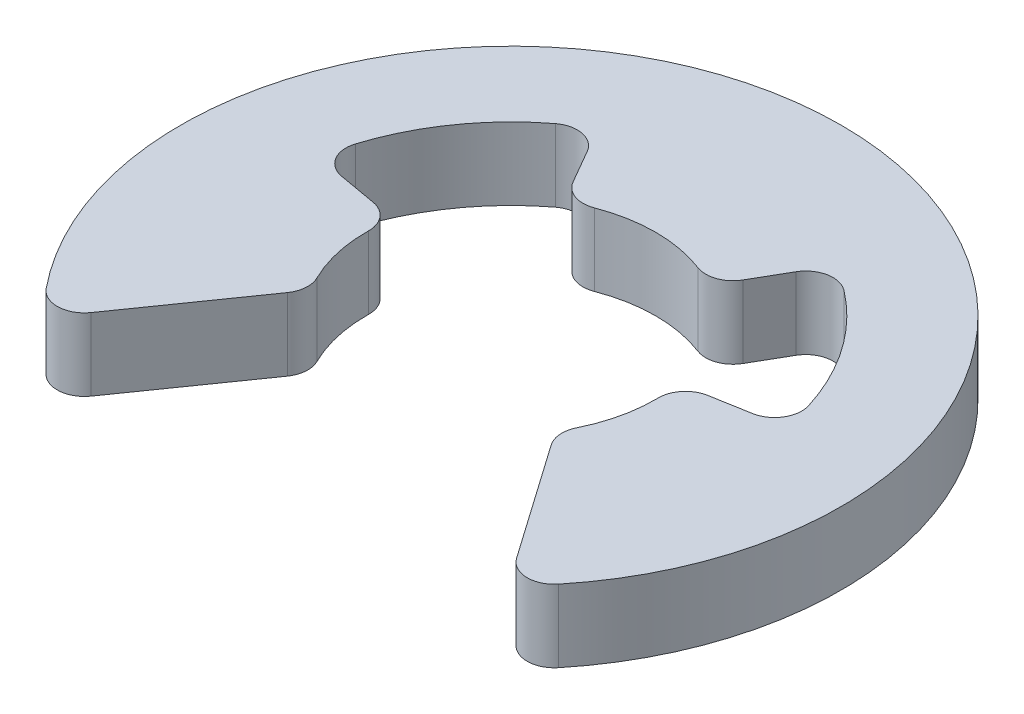
ISO-10303-21;
HEADER;
FILE_DESCRIPTION(('STEP AP214'),'2;1');
FILE_NAME('part.step','',(''),(''),'','','');
FILE_SCHEMA(('AUTOMOTIVE_DESIGN { 1 0 10303 214 1 1 1 1 }'));
ENDSEC;
DATA;
#1=APPLICATION_CONTEXT('core data for automotive mechanical design processes');
#2=APPLICATION_PROTOCOL_DEFINITION('international standard','automotive_design',2000,#1);
#3=PRODUCT_CONTEXT('',#1,'mechanical');
#4=PRODUCT('Part','Part','',(#3));
#5=PRODUCT_RELATED_PRODUCT_CATEGORY('part','',(#4));
#6=PRODUCT_DEFINITION_FORMATION('','',#4);
#7=PRODUCT_DEFINITION_CONTEXT('part definition',#1,'design');
#8=PRODUCT_DEFINITION('design','',#6,#7);
#9=PRODUCT_DEFINITION_SHAPE('','',#8);
#10=(LENGTH_UNIT() NAMED_UNIT(*) SI_UNIT(.MILLI.,.METRE.));
#11=(NAMED_UNIT(*) PLANE_ANGLE_UNIT() SI_UNIT($,.RADIAN.));
#12=(NAMED_UNIT(*) SI_UNIT($,.STERADIAN.) SOLID_ANGLE_UNIT());
#13=UNCERTAINTY_MEASURE_WITH_UNIT(LENGTH_MEASURE(1.E-05),#10,'distance_accuracy_value','');
#14=(GEOMETRIC_REPRESENTATION_CONTEXT(3) GLOBAL_UNCERTAINTY_ASSIGNED_CONTEXT((#13)) GLOBAL_UNIT_ASSIGNED_CONTEXT((#10,
#11,#12)) REPRESENTATION_CONTEXT('',''));
#15=CARTESIAN_POINT('',(0.,0.,0.));
#16=DIRECTION('',(0.,0.,1.));
#17=DIRECTION('',(1.,0.,0.));
#18=AXIS2_PLACEMENT_3D('',#15,#16,#17);
#19=CARTESIAN_POINT('',(0.,0.5,0.));
#20=DIRECTION('',(0.,1.,0.));
#21=DIRECTION('',(0.,0.,1.));
#22=AXIS2_PLACEMENT_3D('',#19,#20,#21);
#23=CYLINDRICAL_SURFACE('',#22,1.6);
#24=CARTESIAN_POINT('',(0.,-0.3,0.));
#25=DIRECTION('',(0.,1.,0.));
#26=DIRECTION('',(0.,0.,1.));
#27=AXIS2_PLACEMENT_3D('',#24,#25,#26);
#28=CIRCLE('',#27,1.6);
#29=CARTESIAN_POINT('',(1.43474212961886,-0.3,0.708177252880062));
#30=VERTEX_POINT('',#29);
#31=CARTESIAN_POINT('',(1.5997958529263,-0.3,-0.0255583442305522));
#32=VERTEX_POINT('',#31);
#33=EDGE_CURVE('E207',#30,#32,#28,.T.);
#34=ORIENTED_EDGE('',*,*,#33,.F.);
#35=DIRECTION('',(0.,1.,0.));
#36=VECTOR('',#35,1.);
#37=CARTESIAN_POINT('',(1.43474212961886,0.5,0.708177252880062));
#38=LINE('',#37,#36);
#39=CARTESIAN_POINT('',(1.43474212961886,0.5,0.708177252880062));
#40=VERTEX_POINT('',#39);
#41=EDGE_CURVE('E222',#30,#40,#38,.T.);
#42=ORIENTED_EDGE('',*,*,#41,.T.);
#43=CARTESIAN_POINT('',(0.,0.5,0.));
#44=DIRECTION('',(0.,1.,0.));
#45=DIRECTION('',(0.,0.,1.));
#46=AXIS2_PLACEMENT_3D('',#43,#44,#45);
#47=CIRCLE('',#46,1.6);
#48=CARTESIAN_POINT('',(1.5997958529263,0.5,-0.0255583442305522));
#49=VERTEX_POINT('',#48);
#50=EDGE_CURVE('E333',#40,#49,#47,.T.);
#51=ORIENTED_EDGE('',*,*,#50,.T.);
#52=DIRECTION('',(0.,1.,0.));
#53=VECTOR('',#52,1.);
#54=CARTESIAN_POINT('',(1.5997958529263,0.5,-0.0255583442305522));
#55=LINE('',#54,#53);
#56=EDGE_CURVE('E225',#49,#32,#55,.F.);
#57=ORIENTED_EDGE('',*,*,#56,.T.);
#58=EDGE_LOOP('',(#34,#42,#51,#57));
#59=FACE_BOUND('',#58,.T.);
#60=ADVANCED_FACE('F33',(#59),#23,.F.);
#61=CARTESIAN_POINT('',(0.571179394382626,-0.3,-1.49457488920184));
#62=VERTEX_POINT('',#61);
#63=CARTESIAN_POINT('',(-0.571179394382626,-0.3,-1.49457488920184));
#64=VERTEX_POINT('',#63);
#65=EDGE_CURVE('E344',#62,#64,#28,.T.);
#66=ORIENTED_EDGE('',*,*,#65,.F.);
#67=DIRECTION('',(0.,1.,0.));
#68=VECTOR('',#67,1.);
#69=CARTESIAN_POINT('',(0.571179394382626,0.5,-1.49457488920184));
#70=LINE('',#69,#68);
#71=CARTESIAN_POINT('',(0.571179394382626,0.5,-1.49457488920184));
#72=VERTEX_POINT('',#71);
#73=EDGE_CURVE('E265',#62,#72,#70,.T.);
#74=ORIENTED_EDGE('',*,*,#73,.T.);
#75=CARTESIAN_POINT('',(-0.571179394382626,0.5,-1.49457488920184));
#76=VERTEX_POINT('',#75);
#77=EDGE_CURVE('E337',#72,#76,#47,.T.);
#78=ORIENTED_EDGE('',*,*,#77,.T.);
#79=DIRECTION('',(0.,1.,0.));
#80=VECTOR('',#79,1.);
#81=CARTESIAN_POINT('',(-0.571179394382626,0.5,-1.49457488920184));
#82=LINE('',#81,#80);
#83=EDGE_CURVE('E263',#76,#64,#82,.F.);
#84=ORIENTED_EDGE('',*,*,#83,.T.);
#85=EDGE_LOOP('',(#66,#74,#78,#84));
#86=FACE_BOUND('',#85,.T.);
#87=ADVANCED_FACE('F383',(#86),#23,.F.);
#88=CARTESIAN_POINT('',(-1.5997958529263,-0.3,-0.0255583442305521));
#89=VERTEX_POINT('',#88);
#90=CARTESIAN_POINT('',(-1.43474212961886,-0.3,0.708177252880062));
#91=VERTEX_POINT('',#90);
#92=EDGE_CURVE('E343',#89,#91,#28,.T.);
#93=ORIENTED_EDGE('',*,*,#92,.F.);
#94=DIRECTION('',(0.,1.,0.));
#95=VECTOR('',#94,1.);
#96=CARTESIAN_POINT('',(-1.5997958529263,0.5,-0.0255583442305521));
#97=LINE('',#96,#95);
#98=CARTESIAN_POINT('',(-1.5997958529263,0.5,-0.0255583442305521));
#99=VERTEX_POINT('',#98);
#100=EDGE_CURVE('E270',#89,#99,#97,.T.);
#101=ORIENTED_EDGE('',*,*,#100,.T.);
#102=CARTESIAN_POINT('',(-1.43474212961886,0.5,0.708177252880062));
#103=VERTEX_POINT('',#102);
#104=EDGE_CURVE('E216',#99,#103,#47,.T.);
#105=ORIENTED_EDGE('',*,*,#104,.T.);
#106=DIRECTION('',(0.,1.,0.));
#107=VECTOR('',#106,1.);
#108=CARTESIAN_POINT('',(-1.43474212961886,0.5,0.708177252880062));
#109=LINE('',#108,#107);
#110=EDGE_CURVE('E268',#103,#91,#109,.F.);
#111=ORIENTED_EDGE('',*,*,#110,.T.);
#112=EDGE_LOOP('',(#93,#101,#105,#111));
#113=FACE_BOUND('',#112,.T.);
#114=ADVANCED_FACE('F440',(#113),#23,.F.);
#115=CARTESIAN_POINT('',(1.6,-0.3,0.));
#116=DIRECTION('',(0.,1.,0.));
#117=DIRECTION('',(0.,0.,1.));
#118=AXIS2_PLACEMENT_3D('',#115,#116,#117);
#119=PLANE('',#118);
#120=CARTESIAN_POINT('',(0.,-0.3,0.));
#121=DIRECTION('',(0.,1.,0.));
#122=DIRECTION('',(0.,0.,1.));
#123=AXIS2_PLACEMENT_3D('',#120,#121,#122);
#124=CIRCLE('',#123,3.65);
#125=CARTESIAN_POINT('',(2.82936417668953,-0.3,2.3059051055206));
#126=VERTEX_POINT('',#125);
#127=CARTESIAN_POINT('',(-2.82936417668953,-0.3,2.3059051055206));
#128=VERTEX_POINT('',#127);
#129=EDGE_CURVE('E340',#126,#128,#124,.T.);
#130=ORIENTED_EDGE('',*,*,#129,.F.);
#131=CARTESIAN_POINT('',(2.59681369641368,-0.3,2.11637865849151));
#132=DIRECTION('',(0.,1.,0.));
#133=DIRECTION('',(0.,0.,1.));
#134=AXIS2_PLACEMENT_3D('',#131,#132,#133);
#135=CIRCLE('',#134,0.3);
#136=CARTESIAN_POINT('',(2.35106808312698,-0.3,2.28845158939683));
#137=VERTEX_POINT('',#136);
#138=EDGE_CURVE('E215',#126,#137,#135,.F.);
#139=ORIENTED_EDGE('',*,*,#138,.T.);
#140=DIRECTION('',(0.573576436351047,0.,0.819152044288991));
#141=VECTOR('',#140,1.);
#142=CARTESIAN_POINT('',(2.56616027524785,-0.3,2.59563507484004));
#143=LINE('',#142,#141);
#144=CARTESIAN_POINT('',(1.45801066563569,-0.3,1.01303341870039));
#145=VERTEX_POINT('',#144);
#146=EDGE_CURVE('E200',#145,#137,#143,.T.);
#147=ORIENTED_EDGE('',*,*,#146,.F.);
#148=CARTESIAN_POINT('',(1.70375627892239,-0.3,0.840960487795073));
#149=DIRECTION('',(0.,1.,0.));
#150=DIRECTION('',(0.,0.,1.));
#151=AXIS2_PLACEMENT_3D('',#148,#149,#150);
#152=CIRCLE('',#151,0.3);
#153=EDGE_CURVE('E212',#145,#30,#152,.F.);
#154=ORIENTED_EDGE('',*,*,#153,.T.);
#155=ORIENTED_EDGE('',*,*,#33,.T.);
#156=CARTESIAN_POINT('',(1.89975757534998,-0.3,-0.0303505337737807));
#157=DIRECTION('',(0.,1.,0.));
#158=DIRECTION('',(0.,0.,1.));
#159=AXIS2_PLACEMENT_3D('',#156,#157,#158);
#160=CIRCLE('',#159,0.3);
#161=CARTESIAN_POINT('',(1.8476631220499,-0.3,-0.325792859677443));
#162=VERTEX_POINT('',#161);
#163=EDGE_CURVE('E223',#32,#162,#160,.F.);
#164=ORIENTED_EDGE('',*,*,#163,.T.);
#165=DIRECTION('',(-0.984807753012207,0.,0.173648177666934));
#166=VECTOR('',#165,1.);
#167=CARTESIAN_POINT('',(2.58512035165704,-0.3,-0.455826466375703));
#168=LINE('',#167,#166);
#169=CARTESIAN_POINT('',(2.27053722578656,-0.3,-0.400356973609128));
#170=VERTEX_POINT('',#169);
#171=EDGE_CURVE('E217',#170,#162,#168,.T.);
#172=ORIENTED_EDGE('',*,*,#171,.F.);
#173=CARTESIAN_POINT('',(2.21844277248648,-0.3,-0.69579929951279));
#174=DIRECTION('',(0.,1.,0.));
#175=DIRECTION('',(0.,0.,1.));
#176=AXIS2_PLACEMENT_3D('',#173,#174,#175);
#177=CIRCLE('',#176,0.3);
#178=CARTESIAN_POINT('',(2.50469345280732,-0.3,-0.785579854288634));
#179=VERTEX_POINT('',#178);
#180=EDGE_CURVE('E279',#170,#179,#177,.T.);
#181=ORIENTED_EDGE('',*,*,#180,.T.);
#182=CARTESIAN_POINT('',(0.,-0.3,0.));
#183=DIRECTION('',(0.,-1.,0.));
#184=DIRECTION('',(0.,0.,1.));
#185=AXIS2_PLACEMENT_3D('',#182,#183,#184);
#186=CIRCLE('',#185,2.625);
#187=CARTESIAN_POINT('',(1.59485920582913,-0.3,-2.08495782057625));
#188=VERTEX_POINT('',#187);
#189=EDGE_CURVE('E328',#188,#179,#186,.T.);
#190=ORIENTED_EDGE('',*,*,#189,.F.);
#191=CARTESIAN_POINT('',(1.4125895823058,-0.3,-1.84667692679611));
#192=DIRECTION('',(0.,1.,0.));
#193=DIRECTION('',(0.,0.,1.));
#194=AXIS2_PLACEMENT_3D('',#191,#192,#193);
#195=CIRCLE('',#194,0.3);
#196=CARTESIAN_POINT('',(1.15278196117047,-0.3,-1.99667692679611));
#197=VERTEX_POINT('',#196);
#198=EDGE_CURVE('E283',#188,#197,#195,.T.);
#199=ORIENTED_EDGE('',*,*,#198,.T.);
#200=DIRECTION('',(0.500000000000007,0.,-0.866025403784435));
#201=VECTOR('',#200,1.);
#202=CARTESIAN_POINT('',(1.31250000000002,-0.3,-2.27331668493414));
#203=LINE('',#202,#201);
#204=CARTESIAN_POINT('',(0.938083151964699,-0.3,-1.62480768092718));
#205=VERTEX_POINT('',#204);
#206=EDGE_CURVE('E325',#205,#197,#203,.T.);
#207=ORIENTED_EDGE('',*,*,#206,.F.);
#208=CARTESIAN_POINT('',(0.678275530829369,-0.3,-1.77480768092719));
#209=DIRECTION('',(0.,1.,0.));
#210=DIRECTION('',(0.,0.,1.));
#211=AXIS2_PLACEMENT_3D('',#208,#209,#210);
#212=CIRCLE('',#211,0.3);
#213=EDGE_CURVE('E227',#205,#62,#212,.F.);
#214=ORIENTED_EDGE('',*,*,#213,.T.);
#215=ORIENTED_EDGE('',*,*,#65,.T.);
#216=CARTESIAN_POINT('',(-0.678275530829369,-0.3,-1.77480768092719));
#217=DIRECTION('',(0.,1.,0.));
#218=DIRECTION('',(0.,0.,1.));
#219=AXIS2_PLACEMENT_3D('',#216,#217,#218);
#220=CIRCLE('',#219,0.3);
#221=CARTESIAN_POINT('',(-0.938083151964699,-0.3,-1.62480768092718));
#222=VERTEX_POINT('',#221);
#223=EDGE_CURVE('E373',#64,#222,#220,.F.);
#224=ORIENTED_EDGE('',*,*,#223,.T.);
#225=DIRECTION('',(0.500000000000007,0.,0.866025403784435));
#226=VECTOR('',#225,1.);
#227=CARTESIAN_POINT('',(-1.31250000000002,-0.3,-2.27331668493414));
#228=LINE('',#227,#226);
#229=CARTESIAN_POINT('',(-1.15278196117047,-0.3,-1.99667692679611));
#230=VERTEX_POINT('',#229);
#231=EDGE_CURVE('E318',#230,#222,#228,.T.);
#232=ORIENTED_EDGE('',*,*,#231,.F.);
#233=CARTESIAN_POINT('',(-1.4125895823058,-0.3,-1.84667692679611));
#234=DIRECTION('',(0.,1.,0.));
#235=DIRECTION('',(0.,0.,1.));
#236=AXIS2_PLACEMENT_3D('',#233,#234,#235);
#237=CIRCLE('',#236,0.3);
#238=CARTESIAN_POINT('',(-1.59485920582913,-0.3,-2.08495782057625));
#239=VERTEX_POINT('',#238);
#240=EDGE_CURVE('E287',#230,#239,#237,.T.);
#241=ORIENTED_EDGE('',*,*,#240,.T.);
#242=CARTESIAN_POINT('',(0.,-0.3,0.));
#243=DIRECTION('',(0.,-1.,0.));
#244=DIRECTION('',(0.,0.,1.));
#245=AXIS2_PLACEMENT_3D('',#242,#243,#244);
#246=CIRCLE('',#245,2.625);
#247=CARTESIAN_POINT('',(-2.50469345280732,-0.3,-0.785579854288634));
#248=VERTEX_POINT('',#247);
#249=EDGE_CURVE('E312',#248,#239,#246,.T.);
#250=ORIENTED_EDGE('',*,*,#249,.F.);
#251=CARTESIAN_POINT('',(-2.21844277248648,-0.3,-0.69579929951279));
#252=DIRECTION('',(0.,1.,0.));
#253=DIRECTION('',(0.,0.,1.));
#254=AXIS2_PLACEMENT_3D('',#251,#252,#253);
#255=CIRCLE('',#254,0.3);
#256=CARTESIAN_POINT('',(-2.27053722578656,-0.3,-0.400356973609128));
#257=VERTEX_POINT('',#256);
#258=EDGE_CURVE('E12',#248,#257,#255,.T.);
#259=ORIENTED_EDGE('',*,*,#258,.T.);
#260=DIRECTION('',(-0.984807753012207,0.,-0.173648177666934));
#261=VECTOR('',#260,1.);
#262=CARTESIAN_POINT('',(-2.58512035165704,-0.3,-0.455826466375702));
#263=LINE('',#262,#261);
#264=CARTESIAN_POINT('',(-1.8476631220499,-0.3,-0.325792859677443));
#265=VERTEX_POINT('',#264);
#266=EDGE_CURVE('E310',#265,#257,#263,.T.);
#267=ORIENTED_EDGE('',*,*,#266,.F.);
#268=CARTESIAN_POINT('',(-1.89975757534998,-0.3,-0.0303505337737807));
#269=DIRECTION('',(0.,1.,0.));
#270=DIRECTION('',(0.,0.,1.));
#271=AXIS2_PLACEMENT_3D('',#268,#269,#270);
#272=CIRCLE('',#271,0.3);
#273=EDGE_CURVE('E371',#265,#89,#272,.F.);
#274=ORIENTED_EDGE('',*,*,#273,.T.);
#275=ORIENTED_EDGE('',*,*,#92,.T.);
#276=CARTESIAN_POINT('',(-1.70375627892239,-0.3,0.840960487795073));
#277=DIRECTION('',(0.,1.,0.));
#278=DIRECTION('',(0.,0.,1.));
#279=AXIS2_PLACEMENT_3D('',#276,#277,#278);
#280=CIRCLE('',#279,0.3);
#281=CARTESIAN_POINT('',(-1.45801066563569,-0.3,1.01303341870039));
#282=VERTEX_POINT('',#281);
#283=EDGE_CURVE('E48',#91,#282,#280,.F.);
#284=ORIENTED_EDGE('',*,*,#283,.T.);
#285=DIRECTION('',(0.573576436351047,0.,-0.819152044288991));
#286=VECTOR('',#285,1.);
#287=CARTESIAN_POINT('',(-2.56616027524785,-0.3,2.59563507484004));
#288=LINE('',#287,#286);
#289=CARTESIAN_POINT('',(-2.35106808312698,-0.3,2.28845158939683));
#290=VERTEX_POINT('',#289);
#291=EDGE_CURVE('E316',#290,#282,#288,.T.);
#292=ORIENTED_EDGE('',*,*,#291,.F.);
#293=CARTESIAN_POINT('',(-2.59681369641368,-0.3,2.11637865849151));
#294=DIRECTION('',(0.,1.,0.));
#295=DIRECTION('',(0.,0.,1.));
#296=AXIS2_PLACEMENT_3D('',#293,#294,#295);
#297=CIRCLE('',#296,0.3);
#298=EDGE_CURVE('E368',#290,#128,#297,.F.);
#299=ORIENTED_EDGE('',*,*,#298,.T.);
#300=EDGE_LOOP('',(#130,#139,#147,#154,#155,#164,#172,#181,#190,#199,#207,#214,#215,#224,#232,
#241,#250,#259,#267,#274,#275,#284,#292,#299));
#301=FACE_BOUND('',#300,.T.);
#302=ADVANCED_FACE('F210',(#301),#119,.F.);
#303=CARTESIAN_POINT('',(0.,0.5,0.));
#304=DIRECTION('',(0.,1.,0.));
#305=DIRECTION('',(0.,0.,1.));
#306=AXIS2_PLACEMENT_3D('',#303,#304,#305);
#307=CYLINDRICAL_SURFACE('',#306,3.65);
#308=CARTESIAN_POINT('',(0.,0.5,0.));
#309=DIRECTION('',(0.,1.,0.));
#310=DIRECTION('',(0.,0.,1.));
#311=AXIS2_PLACEMENT_3D('',#308,#309,#310);
#312=CIRCLE('',#311,3.65);
#313=CARTESIAN_POINT('',(2.82936417668953,0.5,2.3059051055206));
#314=VERTEX_POINT('',#313);
#315=CARTESIAN_POINT('',(-2.82936417668953,0.5,2.3059051055206));
#316=VERTEX_POINT('',#315);
#317=EDGE_CURVE('E336',#314,#316,#312,.T.);
#318=ORIENTED_EDGE('',*,*,#317,.F.);
#319=DIRECTION('',(0.,1.,0.));
#320=VECTOR('',#319,1.);
#321=CARTESIAN_POINT('',(2.82936417668953,0.5,2.3059051055206));
#322=LINE('',#321,#320);
#323=EDGE_CURVE('E366',#314,#126,#322,.F.);
#324=ORIENTED_EDGE('',*,*,#323,.T.);
#325=ORIENTED_EDGE('',*,*,#129,.T.);
#326=DIRECTION('',(0.,1.,0.));
#327=VECTOR('',#326,1.);
#328=CARTESIAN_POINT('',(-2.82936417668953,0.5,2.3059051055206));
#329=LINE('',#328,#327);
#330=EDGE_CURVE('E363',#128,#316,#329,.T.);
#331=ORIENTED_EDGE('',*,*,#330,.T.);
#332=EDGE_LOOP('',(#318,#324,#325,#331));
#333=FACE_BOUND('',#332,.T.);
#334=ADVANCED_FACE('F451',(#333),#307,.T.);
#335=CARTESIAN_POINT('',(1.6,0.5,0.));
#336=DIRECTION('',(0.,-1.,0.));
#337=DIRECTION('',(0.,0.,-1.));
#338=AXIS2_PLACEMENT_3D('',#335,#336,#337);
#339=PLANE('',#338);
#340=DIRECTION('',(0.573576436351047,0.,0.819152044288991));
#341=VECTOR('',#340,1.);
#342=CARTESIAN_POINT('',(2.56616027524785,0.5,2.59563507484004));
#343=LINE('',#342,#341);
#344=CARTESIAN_POINT('',(1.45801066563569,0.5,1.01303341870039));
#345=VERTEX_POINT('',#344);
#346=CARTESIAN_POINT('',(2.35106808312698,0.5,2.28845158939683));
#347=VERTEX_POINT('',#346);
#348=EDGE_CURVE('E203',#345,#347,#343,.T.);
#349=ORIENTED_EDGE('',*,*,#348,.T.);
#350=CARTESIAN_POINT('',(2.59681369641368,0.5,2.11637865849151));
#351=DIRECTION('',(0.,-1.,0.));
#352=DIRECTION('',(0.,0.,-1.));
#353=AXIS2_PLACEMENT_3D('',#350,#351,#352);
#354=CIRCLE('',#353,0.3);
#355=EDGE_CURVE('E361',#347,#314,#354,.F.);
#356=ORIENTED_EDGE('',*,*,#355,.T.);
#357=ORIENTED_EDGE('',*,*,#317,.T.);
#358=CARTESIAN_POINT('',(-2.59681369641368,0.5,2.11637865849151));
#359=DIRECTION('',(0.,-1.,0.));
#360=DIRECTION('',(0.,0.,-1.));
#361=AXIS2_PLACEMENT_3D('',#358,#359,#360);
#362=CIRCLE('',#361,0.3);
#363=CARTESIAN_POINT('',(-2.35106808312698,0.5,2.28845158939683));
#364=VERTEX_POINT('',#363);
#365=EDGE_CURVE('E347',#316,#364,#362,.F.);
#366=ORIENTED_EDGE('',*,*,#365,.T.);
#367=DIRECTION('',(0.573576436351047,0.,-0.819152044288991));
#368=VECTOR('',#367,1.);
#369=CARTESIAN_POINT('',(-2.56616027524785,0.5,2.59563507484004));
#370=LINE('',#369,#368);
#371=CARTESIAN_POINT('',(-1.45801066563569,0.5,1.01303341870039));
#372=VERTEX_POINT('',#371);
#373=EDGE_CURVE('E459',#364,#372,#370,.T.);
#374=ORIENTED_EDGE('',*,*,#373,.T.);
#375=CARTESIAN_POINT('',(-1.70375627892239,0.5,0.840960487795073));
#376=DIRECTION('',(0.,-1.,0.));
#377=DIRECTION('',(0.,0.,-1.));
#378=AXIS2_PLACEMENT_3D('',#375,#376,#377);
#379=CIRCLE('',#378,0.3);
#380=EDGE_CURVE('E349',#372,#103,#379,.F.);
#381=ORIENTED_EDGE('',*,*,#380,.T.);
#382=ORIENTED_EDGE('',*,*,#104,.F.);
#383=CARTESIAN_POINT('',(-1.89975757534998,0.5,-0.0303505337737807));
#384=DIRECTION('',(0.,-1.,0.));
#385=DIRECTION('',(0.,0.,-1.));
#386=AXIS2_PLACEMENT_3D('',#383,#384,#385);
#387=CIRCLE('',#386,0.3);
#388=CARTESIAN_POINT('',(-1.8476631220499,0.5,-0.325792859677443));
#389=VERTEX_POINT('',#388);
#390=EDGE_CURVE('E351',#99,#389,#387,.F.);
#391=ORIENTED_EDGE('',*,*,#390,.T.);
#392=DIRECTION('',(-0.984807753012207,0.,-0.173648177666934));
#393=VECTOR('',#392,1.);
#394=CARTESIAN_POINT('',(-2.58512035165704,0.5,-0.455826466375702));
#395=LINE('',#394,#393);
#396=CARTESIAN_POINT('',(-2.27053722578656,0.5,-0.400356973609128));
#397=VERTEX_POINT('',#396);
#398=EDGE_CURVE('E295',#389,#397,#395,.T.);
#399=ORIENTED_EDGE('',*,*,#398,.T.);
#400=CARTESIAN_POINT('',(-2.21844277248648,0.5,-0.69579929951279));
#401=DIRECTION('',(0.,-1.,0.));
#402=DIRECTION('',(0.,0.,-1.));
#403=AXIS2_PLACEMENT_3D('',#400,#401,#402);
#404=CIRCLE('',#403,0.3);
#405=CARTESIAN_POINT('',(-2.50469345280732,0.5,-0.785579854288634));
#406=VERTEX_POINT('',#405);
#407=EDGE_CURVE('E41',#397,#406,#404,.T.);
#408=ORIENTED_EDGE('',*,*,#407,.T.);
#409=CARTESIAN_POINT('',(0.,0.5,0.));
#410=DIRECTION('',(0.,-1.,0.));
#411=DIRECTION('',(0.,0.,1.));
#412=AXIS2_PLACEMENT_3D('',#409,#410,#411);
#413=CIRCLE('',#412,2.625);
#414=CARTESIAN_POINT('',(-1.59485920582913,0.5,-2.08495782057625));
#415=VERTEX_POINT('',#414);
#416=EDGE_CURVE('E293',#406,#415,#413,.T.);
#417=ORIENTED_EDGE('',*,*,#416,.T.);
#418=CARTESIAN_POINT('',(-1.4125895823058,0.5,-1.84667692679611));
#419=DIRECTION('',(0.,-1.,0.));
#420=DIRECTION('',(0.,0.,-1.));
#421=AXIS2_PLACEMENT_3D('',#418,#419,#420);
#422=CIRCLE('',#421,0.3);
#423=CARTESIAN_POINT('',(-1.15278196117047,0.5,-1.99667692679611));
#424=VERTEX_POINT('',#423);
#425=EDGE_CURVE('E285',#415,#424,#422,.T.);
#426=ORIENTED_EDGE('',*,*,#425,.T.);
#427=DIRECTION('',(0.500000000000007,0.,0.866025403784435));
#428=VECTOR('',#427,1.);
#429=CARTESIAN_POINT('',(-1.31250000000002,0.5,-2.27331668493414));
#430=LINE('',#429,#428);
#431=CARTESIAN_POINT('',(-0.938083151964699,0.5,-1.62480768092718));
#432=VERTEX_POINT('',#431);
#433=EDGE_CURVE('E304',#424,#432,#430,.T.);
#434=ORIENTED_EDGE('',*,*,#433,.T.);
#435=CARTESIAN_POINT('',(-0.678275530829369,0.5,-1.77480768092719));
#436=DIRECTION('',(0.,-1.,0.));
#437=DIRECTION('',(0.,0.,-1.));
#438=AXIS2_PLACEMENT_3D('',#435,#436,#437);
#439=CIRCLE('',#438,0.3);
#440=EDGE_CURVE('E353',#432,#76,#439,.F.);
#441=ORIENTED_EDGE('',*,*,#440,.T.);
#442=ORIENTED_EDGE('',*,*,#77,.F.);
#443=CARTESIAN_POINT('',(0.678275530829369,0.5,-1.77480768092719));
#444=DIRECTION('',(0.,-1.,0.));
#445=DIRECTION('',(0.,0.,-1.));
#446=AXIS2_PLACEMENT_3D('',#443,#444,#445);
#447=CIRCLE('',#446,0.3);
#448=CARTESIAN_POINT('',(0.938083151964699,0.5,-1.62480768092718));
#449=VERTEX_POINT('',#448);
#450=EDGE_CURVE('E355',#72,#449,#447,.F.);
#451=ORIENTED_EDGE('',*,*,#450,.T.);
#452=DIRECTION('',(0.500000000000007,0.,-0.866025403784435));
#453=VECTOR('',#452,1.);
#454=CARTESIAN_POINT('',(1.31250000000002,0.5,-2.27331668493414));
#455=LINE('',#454,#453);
#456=CARTESIAN_POINT('',(1.15278196117047,0.5,-1.99667692679611));
#457=VERTEX_POINT('',#456);
#458=EDGE_CURVE('E390',#449,#457,#455,.T.);
#459=ORIENTED_EDGE('',*,*,#458,.T.);
#460=CARTESIAN_POINT('',(1.4125895823058,0.5,-1.84667692679611));
#461=DIRECTION('',(0.,-1.,0.));
#462=DIRECTION('',(0.,0.,-1.));
#463=AXIS2_PLACEMENT_3D('',#460,#461,#462);
#464=CIRCLE('',#463,0.3);
#465=CARTESIAN_POINT('',(1.59485920582913,0.5,-2.08495782057625));
#466=VERTEX_POINT('',#465);
#467=EDGE_CURVE('E281',#457,#466,#464,.T.);
#468=ORIENTED_EDGE('',*,*,#467,.T.);
#469=CARTESIAN_POINT('',(0.,0.5,0.));
#470=DIRECTION('',(0.,-1.,0.));
#471=DIRECTION('',(0.,0.,1.));
#472=AXIS2_PLACEMENT_3D('',#469,#470,#471);
#473=CIRCLE('',#472,2.625);
#474=CARTESIAN_POINT('',(2.50469345280732,0.5,-0.785579854288634));
#475=VERTEX_POINT('',#474);
#476=EDGE_CURVE('E394',#466,#475,#473,.T.);
#477=ORIENTED_EDGE('',*,*,#476,.T.);
#478=CARTESIAN_POINT('',(2.21844277248648,0.5,-0.69579929951279));
#479=DIRECTION('',(0.,-1.,0.));
#480=DIRECTION('',(0.,0.,-1.));
#481=AXIS2_PLACEMENT_3D('',#478,#479,#480);
#482=CIRCLE('',#481,0.3);
#483=CARTESIAN_POINT('',(2.27053722578656,0.5,-0.400356973609128));
#484=VERTEX_POINT('',#483);
#485=EDGE_CURVE('E277',#475,#484,#482,.T.);
#486=ORIENTED_EDGE('',*,*,#485,.T.);
#487=DIRECTION('',(-0.984807753012207,0.,0.173648177666934));
#488=VECTOR('',#487,1.);
#489=CARTESIAN_POINT('',(2.58512035165704,0.5,-0.455826466375703));
#490=LINE('',#489,#488);
#491=CARTESIAN_POINT('',(1.8476631220499,0.5,-0.325792859677443));
#492=VERTEX_POINT('',#491);
#493=EDGE_CURVE('E397',#484,#492,#490,.T.);
#494=ORIENTED_EDGE('',*,*,#493,.T.);
#495=CARTESIAN_POINT('',(1.89975757534998,0.5,-0.0303505337737807));
#496=DIRECTION('',(0.,-1.,0.));
#497=DIRECTION('',(0.,0.,-1.));
#498=AXIS2_PLACEMENT_3D('',#495,#496,#497);
#499=CIRCLE('',#498,0.3);
#500=EDGE_CURVE('E357',#492,#49,#499,.F.);
#501=ORIENTED_EDGE('',*,*,#500,.T.);
#502=ORIENTED_EDGE('',*,*,#50,.F.);
#503=CARTESIAN_POINT('',(1.70375627892239,0.5,0.840960487795073));
#504=DIRECTION('',(0.,-1.,0.));
#505=DIRECTION('',(0.,0.,-1.));
#506=AXIS2_PLACEMENT_3D('',#503,#504,#505);
#507=CIRCLE('',#506,0.3);
#508=EDGE_CURVE('E359',#40,#345,#507,.F.);
#509=ORIENTED_EDGE('',*,*,#508,.T.);
#510=EDGE_LOOP('',(#349,#356,#357,#366,#374,#381,#382,#391,#399,#408,#417,#426,#434,#441,#442,
#451,#459,#468,#477,#486,#494,#501,#502,#509));
#511=FACE_BOUND('',#510,.T.);
#512=ADVANCED_FACE('F292',(#511),#339,.F.);
#513=CARTESIAN_POINT('',(-2.56616027524785,-0.3,2.59563507484004));
#514=DIRECTION('',(0.819152044288991,0.,0.573576436351047));
#515=DIRECTION('',(0.573576436351047,0.,-0.819152044288991));
#516=AXIS2_PLACEMENT_3D('',#513,#514,#515);
#517=PLANE('',#516);
#518=ORIENTED_EDGE('',*,*,#291,.T.);
#519=DIRECTION('',(0.,-1.,0.));
#520=VECTOR('',#519,1.);
#521=CARTESIAN_POINT('',(-1.45801066563569,0.5,1.01303341870039));
#522=LINE('',#521,#520);
#523=EDGE_CURVE('E274',#282,#372,#522,.F.);
#524=ORIENTED_EDGE('',*,*,#523,.T.);
#525=ORIENTED_EDGE('',*,*,#373,.F.);
#526=DIRECTION('',(0.,-1.,0.));
#527=VECTOR('',#526,1.);
#528=CARTESIAN_POINT('',(-2.35106808312698,-0.3,2.28845158939683));
#529=LINE('',#528,#527);
#530=EDGE_CURVE('E55',#364,#290,#529,.T.);
#531=ORIENTED_EDGE('',*,*,#530,.T.);
#532=EDGE_LOOP('',(#518,#524,#525,#531));
#533=FACE_BOUND('',#532,.T.);
#534=ADVANCED_FACE('F463',(#533),#517,.T.);
#535=CARTESIAN_POINT('',(-2.58512035165704,-0.3,-0.455826466375702));
#536=DIRECTION('',(0.173648177666934,0.,-0.984807753012207));
#537=DIRECTION('',(-0.984807753012207,0.,-0.173648177666934));
#538=AXIS2_PLACEMENT_3D('',#535,#536,#537);
#539=PLANE('',#538);
#540=ORIENTED_EDGE('',*,*,#266,.T.);
#541=DIRECTION('',(0.,-1.,0.));
#542=VECTOR('',#541,1.);
#543=CARTESIAN_POINT('',(-2.27053722578656,0.5,-0.400356973609128));
#544=LINE('',#543,#542);
#545=EDGE_CURVE('E260',#257,#397,#544,.F.);
#546=ORIENTED_EDGE('',*,*,#545,.T.);
#547=ORIENTED_EDGE('',*,*,#398,.F.);
#548=DIRECTION('',(0.,-1.,0.));
#549=VECTOR('',#548,1.);
#550=CARTESIAN_POINT('',(-1.8476631220499,-0.3,-0.325792859677443));
#551=LINE('',#550,#549);
#552=EDGE_CURVE('E258',#389,#265,#551,.T.);
#553=ORIENTED_EDGE('',*,*,#552,.T.);
#554=EDGE_LOOP('',(#540,#546,#547,#553));
#555=FACE_BOUND('',#554,.T.);
#556=ADVANCED_FACE('F314',(#555),#539,.T.);
#557=CARTESIAN_POINT('',(0.,-0.3,0.));
#558=DIRECTION('',(0.,1.,0.));
#559=DIRECTION('',(0.,0.,1.));
#560=AXIS2_PLACEMENT_3D('',#557,#558,#559);
#561=CYLINDRICAL_SURFACE('',#560,2.625);
#562=ORIENTED_EDGE('',*,*,#249,.T.);
#563=DIRECTION('',(0.,1.,0.));
#564=VECTOR('',#563,1.);
#565=CARTESIAN_POINT('',(-1.59485920582913,-0.3,-2.08495782057625));
#566=LINE('',#565,#564);
#567=EDGE_CURVE('E250',#239,#415,#566,.T.);
#568=ORIENTED_EDGE('',*,*,#567,.T.);
#569=ORIENTED_EDGE('',*,*,#416,.F.);
#570=DIRECTION('',(0.,1.,0.));
#571=VECTOR('',#570,1.);
#572=CARTESIAN_POINT('',(-2.50469345280732,-0.3,-0.785579854288634));
#573=LINE('',#572,#571);
#574=EDGE_CURVE('E248',#406,#248,#573,.F.);
#575=ORIENTED_EDGE('',*,*,#574,.T.);
#576=EDGE_LOOP('',(#562,#568,#569,#575));
#577=FACE_BOUND('',#576,.T.);
#578=ADVANCED_FACE('F301',(#577),#561,.F.);
#579=CARTESIAN_POINT('',(-1.31250000000002,-0.3,-2.27331668493414));
#580=DIRECTION('',(-0.866025403784434,0.,0.500000000000007));
#581=DIRECTION('',(0.500000000000007,0.,0.866025403784434));
#582=AXIS2_PLACEMENT_3D('',#579,#580,#581);
#583=PLANE('',#582);
#584=ORIENTED_EDGE('',*,*,#433,.F.);
#585=DIRECTION('',(0.,-1.,0.));
#586=VECTOR('',#585,1.);
#587=CARTESIAN_POINT('',(-1.15278196117047,-0.3,-1.99667692679611));
#588=LINE('',#587,#586);
#589=EDGE_CURVE('E256',#424,#230,#588,.T.);
#590=ORIENTED_EDGE('',*,*,#589,.T.);
#591=ORIENTED_EDGE('',*,*,#231,.T.);
#592=DIRECTION('',(0.,-1.,0.));
#593=VECTOR('',#592,1.);
#594=CARTESIAN_POINT('',(-0.938083151964699,0.5,-1.62480768092718));
#595=LINE('',#594,#593);
#596=EDGE_CURVE('E253',#222,#432,#595,.F.);
#597=ORIENTED_EDGE('',*,*,#596,.T.);
#598=EDGE_LOOP('',(#584,#590,#591,#597));
#599=FACE_BOUND('',#598,.T.);
#600=ADVANCED_FACE('F558',(#599),#583,.T.);
#601=CARTESIAN_POINT('',(1.31250000000002,-0.3,-2.27331668493414));
#602=DIRECTION('',(0.866025403784434,0.,0.500000000000007));
#603=DIRECTION('',(0.500000000000007,0.,-0.866025403784435));
#604=AXIS2_PLACEMENT_3D('',#601,#602,#603);
#605=PLANE('',#604);
#606=ORIENTED_EDGE('',*,*,#206,.T.);
#607=DIRECTION('',(0.,-1.,0.));
#608=VECTOR('',#607,1.);
#609=CARTESIAN_POINT('',(1.15278196117047,0.5,-1.99667692679611));
#610=LINE('',#609,#608);
#611=EDGE_CURVE('E245',#197,#457,#610,.F.);
#612=ORIENTED_EDGE('',*,*,#611,.T.);
#613=ORIENTED_EDGE('',*,*,#458,.F.);
#614=DIRECTION('',(0.,-1.,0.));
#615=VECTOR('',#614,1.);
#616=CARTESIAN_POINT('',(0.938083151964699,-0.3,-1.62480768092718));
#617=LINE('',#616,#615);
#618=EDGE_CURVE('E243',#449,#205,#617,.T.);
#619=ORIENTED_EDGE('',*,*,#618,.T.);
#620=EDGE_LOOP('',(#606,#612,#613,#619));
#621=FACE_BOUND('',#620,.T.);
#622=ADVANCED_FACE('F392',(#621),#605,.T.);
#623=CARTESIAN_POINT('',(0.,-0.3,0.));
#624=DIRECTION('',(0.,1.,0.));
#625=DIRECTION('',(0.,0.,1.));
#626=AXIS2_PLACEMENT_3D('',#623,#624,#625);
#627=CYLINDRICAL_SURFACE('',#626,2.625);
#628=ORIENTED_EDGE('',*,*,#189,.T.);
#629=DIRECTION('',(0.,1.,0.));
#630=VECTOR('',#629,1.);
#631=CARTESIAN_POINT('',(2.50469345280732,-0.3,-0.785579854288634));
#632=LINE('',#631,#630);
#633=EDGE_CURVE('E240',#179,#475,#632,.T.);
#634=ORIENTED_EDGE('',*,*,#633,.T.);
#635=ORIENTED_EDGE('',*,*,#476,.F.);
#636=DIRECTION('',(0.,1.,0.));
#637=VECTOR('',#636,1.);
#638=CARTESIAN_POINT('',(1.59485920582913,-0.3,-2.08495782057625));
#639=LINE('',#638,#637);
#640=EDGE_CURVE('E238',#466,#188,#639,.F.);
#641=ORIENTED_EDGE('',*,*,#640,.T.);
#642=EDGE_LOOP('',(#628,#634,#635,#641));
#643=FACE_BOUND('',#642,.T.);
#644=ADVANCED_FACE('F422',(#643),#627,.F.);
#645=CARTESIAN_POINT('',(2.58512035165704,-0.3,-0.455826466375703));
#646=DIRECTION('',(-0.173648177666934,0.,-0.984807753012207));
#647=DIRECTION('',(-0.984807753012207,0.,0.173648177666934));
#648=AXIS2_PLACEMENT_3D('',#645,#646,#647);
#649=PLANE('',#648);
#650=ORIENTED_EDGE('',*,*,#171,.T.);
#651=DIRECTION('',(0.,-1.,0.));
#652=VECTOR('',#651,1.);
#653=CARTESIAN_POINT('',(1.8476631220499,0.5,-0.325792859677443));
#654=LINE('',#653,#652);
#655=EDGE_CURVE('E235',#162,#492,#654,.F.);
#656=ORIENTED_EDGE('',*,*,#655,.T.);
#657=ORIENTED_EDGE('',*,*,#493,.F.);
#658=DIRECTION('',(0.,-1.,0.));
#659=VECTOR('',#658,1.);
#660=CARTESIAN_POINT('',(2.27053722578656,-0.3,-0.400356973609128));
#661=LINE('',#660,#659);
#662=EDGE_CURVE('E233',#484,#170,#661,.T.);
#663=ORIENTED_EDGE('',*,*,#662,.T.);
#664=EDGE_LOOP('',(#650,#656,#657,#663));
#665=FACE_BOUND('',#664,.T.);
#666=ADVANCED_FACE('F414',(#665),#649,.T.);
#667=CARTESIAN_POINT('',(2.56616027524785,-0.3,2.59563507484004));
#668=DIRECTION('',(-0.819152044288991,0.,0.573576436351047));
#669=DIRECTION('',(0.573576436351047,0.,0.819152044288991));
#670=AXIS2_PLACEMENT_3D('',#667,#668,#669);
#671=PLANE('',#670);
#672=ORIENTED_EDGE('',*,*,#146,.T.);
#673=DIRECTION('',(0.,-1.,0.));
#674=VECTOR('',#673,1.);
#675=CARTESIAN_POINT('',(2.35106808312698,0.5,2.28845158939683));
#676=LINE('',#675,#674);
#677=EDGE_CURVE('E206',#137,#347,#676,.F.);
#678=ORIENTED_EDGE('',*,*,#677,.T.);
#679=ORIENTED_EDGE('',*,*,#348,.F.);
#680=DIRECTION('',(0.,-1.,0.));
#681=VECTOR('',#680,1.);
#682=CARTESIAN_POINT('',(1.45801066563569,-0.3,1.01303341870039));
#683=LINE('',#682,#681);
#684=EDGE_CURVE('E196',#345,#145,#683,.T.);
#685=ORIENTED_EDGE('',*,*,#684,.T.);
#686=EDGE_LOOP('',(#672,#678,#679,#685));
#687=FACE_BOUND('',#686,.T.);
#688=ADVANCED_FACE('F198',(#687),#671,.T.);
#689=CARTESIAN_POINT('',(2.59681369641368,0.5,2.11637865849151));
#690=DIRECTION('',(0.,1.,0.));
#691=DIRECTION('',(0.,0.,1.));
#692=AXIS2_PLACEMENT_3D('',#689,#690,#691);
#693=CYLINDRICAL_SURFACE('',#692,0.3);
#694=ORIENTED_EDGE('',*,*,#138,.F.);
#695=ORIENTED_EDGE('',*,*,#323,.F.);
#696=ORIENTED_EDGE('',*,*,#355,.F.);
#697=ORIENTED_EDGE('',*,*,#677,.F.);
#698=EDGE_LOOP('',(#694,#695,#696,#697));
#699=FACE_BOUND('',#698,.T.);
#700=ADVANCED_FACE('F471',(#699),#693,.T.);
#701=CARTESIAN_POINT('',(1.70375627892239,0.5,0.840960487795073));
#702=DIRECTION('',(0.,1.,0.));
#703=DIRECTION('',(0.,0.,1.));
#704=AXIS2_PLACEMENT_3D('',#701,#702,#703);
#705=CYLINDRICAL_SURFACE('',#704,0.3);
#706=ORIENTED_EDGE('',*,*,#153,.F.);
#707=ORIENTED_EDGE('',*,*,#684,.F.);
#708=ORIENTED_EDGE('',*,*,#508,.F.);
#709=ORIENTED_EDGE('',*,*,#41,.F.);
#710=EDGE_LOOP('',(#706,#707,#708,#709));
#711=FACE_BOUND('',#710,.T.);
#712=ADVANCED_FACE('F220',(#711),#705,.T.);
#713=CARTESIAN_POINT('',(1.89975757534998,0.5,-0.0303505337737807));
#714=DIRECTION('',(0.,1.,0.));
#715=DIRECTION('',(0.,0.,1.));
#716=AXIS2_PLACEMENT_3D('',#713,#714,#715);
#717=CYLINDRICAL_SURFACE('',#716,0.3);
#718=ORIENTED_EDGE('',*,*,#163,.F.);
#719=ORIENTED_EDGE('',*,*,#56,.F.);
#720=ORIENTED_EDGE('',*,*,#500,.F.);
#721=ORIENTED_EDGE('',*,*,#655,.F.);
#722=EDGE_LOOP('',(#718,#719,#720,#721));
#723=FACE_BOUND('',#722,.T.);
#724=ADVANCED_FACE('F411',(#723),#717,.T.);
#725=CARTESIAN_POINT('',(2.21844277248648,-0.3,-0.69579929951279));
#726=DIRECTION('',(0.,1.,0.));
#727=DIRECTION('',(0.,0.,1.));
#728=AXIS2_PLACEMENT_3D('',#725,#726,#727);
#729=CYLINDRICAL_SURFACE('',#728,0.3);
#730=ORIENTED_EDGE('',*,*,#180,.F.);
#731=ORIENTED_EDGE('',*,*,#662,.F.);
#732=ORIENTED_EDGE('',*,*,#485,.F.);
#733=ORIENTED_EDGE('',*,*,#633,.F.);
#734=EDGE_LOOP('',(#730,#731,#732,#733));
#735=FACE_BOUND('',#734,.T.);
#736=ADVANCED_FACE('F420',(#735),#729,.F.);
#737=CARTESIAN_POINT('',(1.4125895823058,-0.3,-1.84667692679611));
#738=DIRECTION('',(0.,1.,0.));
#739=DIRECTION('',(0.,0.,1.));
#740=AXIS2_PLACEMENT_3D('',#737,#738,#739);
#741=CYLINDRICAL_SURFACE('',#740,0.3);
#742=ORIENTED_EDGE('',*,*,#198,.F.);
#743=ORIENTED_EDGE('',*,*,#640,.F.);
#744=ORIENTED_EDGE('',*,*,#467,.F.);
#745=ORIENTED_EDGE('',*,*,#611,.F.);
#746=EDGE_LOOP('',(#742,#743,#744,#745));
#747=FACE_BOUND('',#746,.T.);
#748=ADVANCED_FACE('F427',(#747),#741,.F.);
#749=CARTESIAN_POINT('',(-1.4125895823058,-0.3,-1.84667692679611));
#750=DIRECTION('',(0.,1.,0.));
#751=DIRECTION('',(0.,0.,1.));
#752=AXIS2_PLACEMENT_3D('',#749,#750,#751);
#753=CYLINDRICAL_SURFACE('',#752,0.3);
#754=ORIENTED_EDGE('',*,*,#240,.F.);
#755=ORIENTED_EDGE('',*,*,#589,.F.);
#756=ORIENTED_EDGE('',*,*,#425,.F.);
#757=ORIENTED_EDGE('',*,*,#567,.F.);
#758=EDGE_LOOP('',(#754,#755,#756,#757));
#759=FACE_BOUND('',#758,.T.);
#760=ADVANCED_FACE('F429',(#759),#753,.F.);
#761=CARTESIAN_POINT('',(-2.21844277248648,-0.3,-0.69579929951279));
#762=DIRECTION('',(0.,1.,0.));
#763=DIRECTION('',(0.,0.,1.));
#764=AXIS2_PLACEMENT_3D('',#761,#762,#763);
#765=CYLINDRICAL_SURFACE('',#764,0.3);
#766=ORIENTED_EDGE('',*,*,#258,.F.);
#767=ORIENTED_EDGE('',*,*,#574,.F.);
#768=ORIENTED_EDGE('',*,*,#407,.F.);
#769=ORIENTED_EDGE('',*,*,#545,.F.);
#770=EDGE_LOOP('',(#766,#767,#768,#769));
#771=FACE_BOUND('',#770,.T.);
#772=ADVANCED_FACE('F307',(#771),#765,.F.);
#773=CARTESIAN_POINT('',(0.678275530829369,0.5,-1.77480768092719));
#774=DIRECTION('',(0.,1.,0.));
#775=DIRECTION('',(0.,0.,1.));
#776=AXIS2_PLACEMENT_3D('',#773,#774,#775);
#777=CYLINDRICAL_SURFACE('',#776,0.3);
#778=ORIENTED_EDGE('',*,*,#213,.F.);
#779=ORIENTED_EDGE('',*,*,#618,.F.);
#780=ORIENTED_EDGE('',*,*,#450,.F.);
#781=ORIENTED_EDGE('',*,*,#73,.F.);
#782=EDGE_LOOP('',(#778,#779,#780,#781));
#783=FACE_BOUND('',#782,.T.);
#784=ADVANCED_FACE('F387',(#783),#777,.T.);
#785=CARTESIAN_POINT('',(-0.678275530829369,0.5,-1.77480768092719));
#786=DIRECTION('',(0.,1.,0.));
#787=DIRECTION('',(0.,0.,1.));
#788=AXIS2_PLACEMENT_3D('',#785,#786,#787);
#789=CYLINDRICAL_SURFACE('',#788,0.3);
#790=ORIENTED_EDGE('',*,*,#223,.F.);
#791=ORIENTED_EDGE('',*,*,#83,.F.);
#792=ORIENTED_EDGE('',*,*,#440,.F.);
#793=ORIENTED_EDGE('',*,*,#596,.F.);
#794=EDGE_LOOP('',(#790,#791,#792,#793));
#795=FACE_BOUND('',#794,.T.);
#796=ADVANCED_FACE('F516',(#795),#789,.T.);
#797=CARTESIAN_POINT('',(-1.89975757534998,0.5,-0.0303505337737807));
#798=DIRECTION('',(0.,1.,0.));
#799=DIRECTION('',(0.,0.,1.));
#800=AXIS2_PLACEMENT_3D('',#797,#798,#799);
#801=CYLINDRICAL_SURFACE('',#800,0.3);
#802=ORIENTED_EDGE('',*,*,#273,.F.);
#803=ORIENTED_EDGE('',*,*,#552,.F.);
#804=ORIENTED_EDGE('',*,*,#390,.F.);
#805=ORIENTED_EDGE('',*,*,#100,.F.);
#806=EDGE_LOOP('',(#802,#803,#804,#805));
#807=FACE_BOUND('',#806,.T.);
#808=ADVANCED_FACE('F458',(#807),#801,.T.);
#809=CARTESIAN_POINT('',(-1.70375627892239,0.5,0.840960487795073));
#810=DIRECTION('',(0.,1.,0.));
#811=DIRECTION('',(0.,0.,1.));
#812=AXIS2_PLACEMENT_3D('',#809,#810,#811);
#813=CYLINDRICAL_SURFACE('',#812,0.3);
#814=ORIENTED_EDGE('',*,*,#283,.F.);
#815=ORIENTED_EDGE('',*,*,#110,.F.);
#816=ORIENTED_EDGE('',*,*,#380,.F.);
#817=ORIENTED_EDGE('',*,*,#523,.F.);
#818=EDGE_LOOP('',(#814,#815,#816,#817));
#819=FACE_BOUND('',#818,.T.);
#820=ADVANCED_FACE('F534',(#819),#813,.T.);
#821=CARTESIAN_POINT('',(-2.59681369641368,0.5,2.11637865849151));
#822=DIRECTION('',(0.,1.,0.));
#823=DIRECTION('',(0.,0.,1.));
#824=AXIS2_PLACEMENT_3D('',#821,#822,#823);
#825=CYLINDRICAL_SURFACE('',#824,0.3);
#826=ORIENTED_EDGE('',*,*,#298,.F.);
#827=ORIENTED_EDGE('',*,*,#530,.F.);
#828=ORIENTED_EDGE('',*,*,#365,.F.);
#829=ORIENTED_EDGE('',*,*,#330,.F.);
#830=EDGE_LOOP('',(#826,#827,#828,#829));
#831=FACE_BOUND('',#830,.T.);
#832=ADVANCED_FACE('F35',(#831),#825,.T.);
#833=CLOSED_SHELL('',(#60,#87,#114,#302,#334,#512,#534,#556,#578,#600,#622,#644,#666,#688,#700,
#712,#724,#736,#748,#760,#772,#784,#796,#808,#820,#832));
#834=MANIFOLD_SOLID_BREP('B2',#833);
#835=ADVANCED_BREP_SHAPE_REPRESENTATION('',(#18,#834),#14);
#836=SHAPE_DEFINITION_REPRESENTATION(#9,#835);
ENDSEC;
END-ISO-10303-21;
